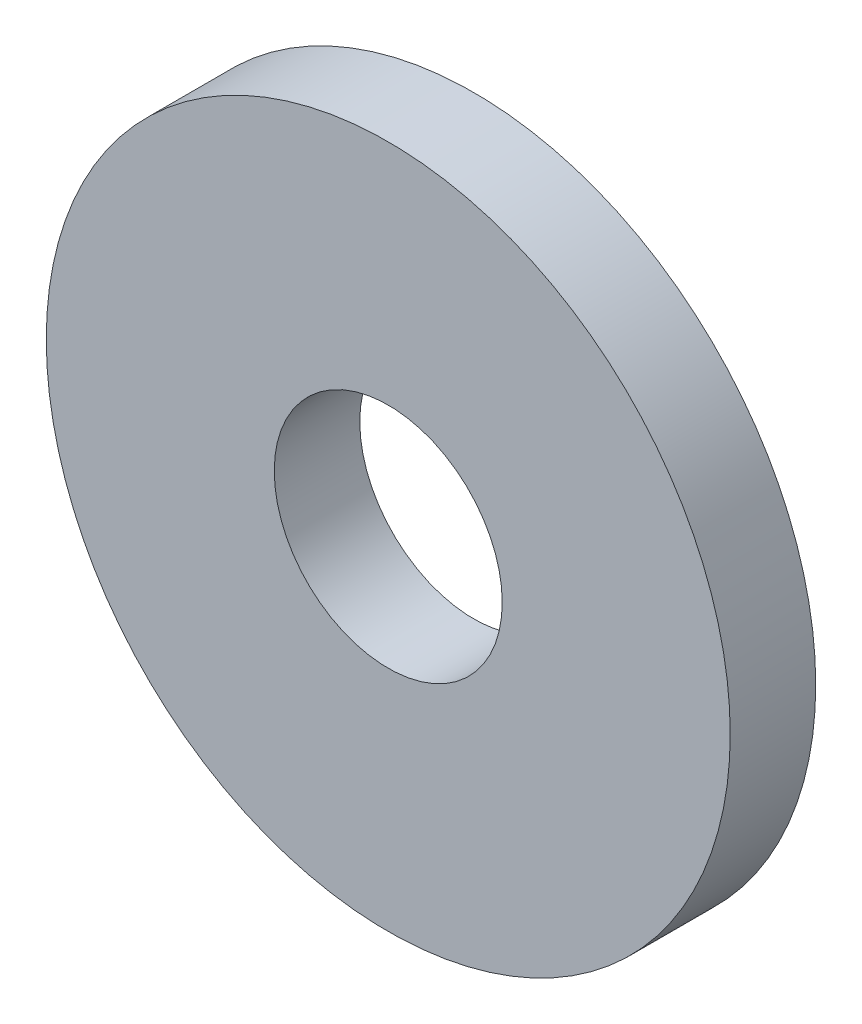
ISO-10303-21;
HEADER;
FILE_DESCRIPTION(('STEP AP214'),'2;1');
FILE_NAME('part.step','',(''),(''),'','','');
FILE_SCHEMA(('AUTOMOTIVE_DESIGN { 1 0 10303 214 1 1 1 1 }'));
ENDSEC;
DATA;
#1=APPLICATION_CONTEXT('core data for automotive mechanical design processes');
#2=APPLICATION_PROTOCOL_DEFINITION('international standard','automotive_design',2000,#1);
#3=PRODUCT_CONTEXT('',#1,'mechanical');
#4=PRODUCT('Part','Part','',(#3));
#5=PRODUCT_RELATED_PRODUCT_CATEGORY('part','',(#4));
#6=PRODUCT_DEFINITION_FORMATION('','',#4);
#7=PRODUCT_DEFINITION_CONTEXT('part definition',#1,'design');
#8=PRODUCT_DEFINITION('design','',#6,#7);
#9=PRODUCT_DEFINITION_SHAPE('','',#8);
#10=(LENGTH_UNIT() NAMED_UNIT(*) SI_UNIT(.MILLI.,.METRE.));
#11=(NAMED_UNIT(*) PLANE_ANGLE_UNIT() SI_UNIT($,.RADIAN.));
#12=(NAMED_UNIT(*) SI_UNIT($,.STERADIAN.) SOLID_ANGLE_UNIT());
#13=UNCERTAINTY_MEASURE_WITH_UNIT(LENGTH_MEASURE(1.E-05),#10,'distance_accuracy_value','');
#14=(GEOMETRIC_REPRESENTATION_CONTEXT(3) GLOBAL_UNCERTAINTY_ASSIGNED_CONTEXT((#13)) GLOBAL_UNIT_ASSIGNED_CONTEXT((#10,
#11,#12)) REPRESENTATION_CONTEXT('',''));
#15=CARTESIAN_POINT('',(0.,0.,0.));
#16=DIRECTION('',(0.,0.,1.));
#17=DIRECTION('',(1.,0.,0.));
#18=AXIS2_PLACEMENT_3D('',#15,#16,#17);
#19=CARTESIAN_POINT('',(0.,0.,1.5));
#20=DIRECTION('',(0.,0.,1.));
#21=DIRECTION('',(1.,0.,0.));
#22=AXIS2_PLACEMENT_3D('',#19,#20,#21);
#23=PLANE('',#22);
#24=CARTESIAN_POINT('',(0.,0.,1.5));
#25=DIRECTION('',(0.,0.,1.));
#26=DIRECTION('',(1.,0.,0.));
#27=AXIS2_PLACEMENT_3D('',#24,#25,#26);
#28=CIRCLE('',#27,6.);
#29=CARTESIAN_POINT('',(6.,0.,1.5));
#30=VERTEX_POINT('',#29);
#31=EDGE_CURVE('E10',#30,#30,#28,.T.);
#32=ORIENTED_EDGE('',*,*,#31,.T.);
#33=EDGE_LOOP('',(#32));
#34=FACE_BOUND('',#33,.T.);
#35=CARTESIAN_POINT('',(0.,0.,1.5));
#36=DIRECTION('',(0.,0.,1.));
#37=DIRECTION('',(1.,0.,0.));
#38=AXIS2_PLACEMENT_3D('',#35,#36,#37);
#39=CIRCLE('',#38,2.);
#40=CARTESIAN_POINT('',(2.,0.,1.5));
#41=VERTEX_POINT('',#40);
#42=EDGE_CURVE('E50',#41,#41,#39,.T.);
#43=ORIENTED_EDGE('',*,*,#42,.F.);
#44=EDGE_LOOP('',(#43));
#45=FACE_BOUND('',#44,.T.);
#46=ADVANCED_FACE('F37',(#34,#45),#23,.T.);
#47=CARTESIAN_POINT('',(0.,0.,0.));
#48=DIRECTION('',(0.,0.,1.));
#49=DIRECTION('',(1.,0.,0.));
#50=AXIS2_PLACEMENT_3D('',#47,#48,#49);
#51=PLANE('',#50);
#52=CARTESIAN_POINT('',(0.,0.,0.));
#53=DIRECTION('',(0.,0.,1.));
#54=DIRECTION('',(1.,0.,0.));
#55=AXIS2_PLACEMENT_3D('',#52,#53,#54);
#56=CIRCLE('',#55,6.);
#57=CARTESIAN_POINT('',(6.,0.,0.));
#58=VERTEX_POINT('',#57);
#59=EDGE_CURVE('E41',#58,#58,#56,.T.);
#60=ORIENTED_EDGE('',*,*,#59,.F.);
#61=EDGE_LOOP('',(#60));
#62=FACE_BOUND('',#61,.T.);
#63=CARTESIAN_POINT('',(0.,0.,0.));
#64=DIRECTION('',(0.,0.,1.));
#65=DIRECTION('',(1.,0.,0.));
#66=AXIS2_PLACEMENT_3D('',#63,#64,#65);
#67=CIRCLE('',#66,2.);
#68=CARTESIAN_POINT('',(2.,0.,0.));
#69=VERTEX_POINT('',#68);
#70=EDGE_CURVE('E52',#69,#69,#67,.T.);
#71=ORIENTED_EDGE('',*,*,#70,.T.);
#72=EDGE_LOOP('',(#71));
#73=FACE_BOUND('',#72,.T.);
#74=ADVANCED_FACE('F64',(#62,#73),#51,.F.);
#75=CARTESIAN_POINT('',(0.,0.,1.5));
#76=DIRECTION('',(0.,0.,-1.));
#77=DIRECTION('',(-1.,0.,0.));
#78=AXIS2_PLACEMENT_3D('',#75,#76,#77);
#79=CYLINDRICAL_SURFACE('',#78,6.);
#80=ORIENTED_EDGE('',*,*,#31,.F.);
#81=EDGE_LOOP('',(#80));
#82=FACE_BOUND('',#81,.T.);
#83=ORIENTED_EDGE('',*,*,#59,.T.);
#84=EDGE_LOOP('',(#83));
#85=FACE_BOUND('',#84,.T.);
#86=ADVANCED_FACE('F39',(#82,#85),#79,.T.);
#87=CARTESIAN_POINT('',(0.,0.,1.5));
#88=DIRECTION('',(0.,0.,-1.));
#89=DIRECTION('',(-1.,0.,0.));
#90=AXIS2_PLACEMENT_3D('',#87,#88,#89);
#91=CYLINDRICAL_SURFACE('',#90,2.);
#92=ORIENTED_EDGE('',*,*,#42,.T.);
#93=EDGE_LOOP('',(#92));
#94=FACE_BOUND('',#93,.T.);
#95=ORIENTED_EDGE('',*,*,#70,.F.);
#96=EDGE_LOOP('',(#95));
#97=FACE_BOUND('',#96,.T.);
#98=ADVANCED_FACE('F60',(#94,#97),#91,.F.);
#99=CLOSED_SHELL('',(#46,#74,#86,#98));
#100=MANIFOLD_SOLID_BREP('B2',#99);
#101=ADVANCED_BREP_SHAPE_REPRESENTATION('',(#18,#100),#14);
#102=SHAPE_DEFINITION_REPRESENTATION(#9,#101);
ENDSEC;
END-ISO-10303-21;
